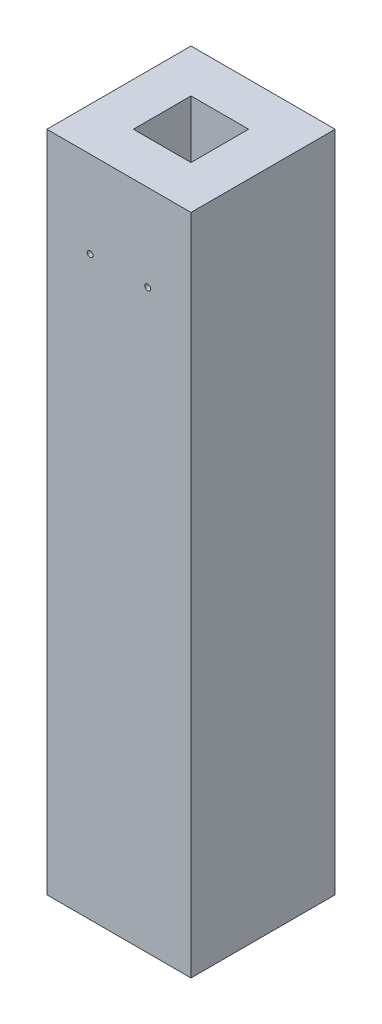
ISO-10303-21;
HEADER;
FILE_DESCRIPTION(('STEP AP214'),'2;1');
FILE_NAME('part.step','',(''),(''),'','','');
FILE_SCHEMA(('AUTOMOTIVE_DESIGN { 1 0 10303 214 1 1 1 1 }'));
ENDSEC;
DATA;
#1=APPLICATION_CONTEXT('core data for automotive mechanical design processes');
#2=APPLICATION_PROTOCOL_DEFINITION('international standard','automotive_design',2000,#1);
#3=PRODUCT_CONTEXT('',#1,'mechanical');
#4=PRODUCT('Part','Part','',(#3));
#5=PRODUCT_RELATED_PRODUCT_CATEGORY('part','',(#4));
#6=PRODUCT_DEFINITION_FORMATION('','',#4);
#7=PRODUCT_DEFINITION_CONTEXT('part definition',#1,'design');
#8=PRODUCT_DEFINITION('design','',#6,#7);
#9=PRODUCT_DEFINITION_SHAPE('','',#8);
#10=(LENGTH_UNIT() NAMED_UNIT(*) SI_UNIT(.MILLI.,.METRE.));
#11=(NAMED_UNIT(*) PLANE_ANGLE_UNIT() SI_UNIT($,.RADIAN.));
#12=(NAMED_UNIT(*) SI_UNIT($,.STERADIAN.) SOLID_ANGLE_UNIT());
#13=UNCERTAINTY_MEASURE_WITH_UNIT(LENGTH_MEASURE(1.E-05),#10,'distance_accuracy_value','');
#14=(GEOMETRIC_REPRESENTATION_CONTEXT(3) GLOBAL_UNCERTAINTY_ASSIGNED_CONTEXT((#13)) GLOBAL_UNIT_ASSIGNED_CONTEXT((#10,
#11,#12)) REPRESENTATION_CONTEXT('',''));
#15=CARTESIAN_POINT('',(0.,0.,0.));
#16=DIRECTION('',(0.,0.,1.));
#17=DIRECTION('',(1.,0.,0.));
#18=AXIS2_PLACEMENT_3D('',#15,#16,#17);
#19=CARTESIAN_POINT('',(-25.,230.,-25.));
#20=DIRECTION('',(1.,0.,0.));
#21=DIRECTION('',(0.,0.,-1.));
#22=AXIS2_PLACEMENT_3D('',#19,#20,#21);
#23=PLANE('',#22);
#24=DIRECTION('',(0.,0.,1.));
#25=VECTOR('',#24,1.);
#26=CARTESIAN_POINT('',(-25.,0.,-25.));
#27=LINE('',#26,#25);
#28=CARTESIAN_POINT('',(-25.,0.,-25.));
#29=VERTEX_POINT('',#28);
#30=CARTESIAN_POINT('',(-25.,0.,25.));
#31=VERTEX_POINT('',#30);
#32=EDGE_CURVE('E200',#29,#31,#27,.T.);
#33=ORIENTED_EDGE('',*,*,#32,.T.);
#34=DIRECTION('',(0.,-1.,0.));
#35=VECTOR('',#34,1.);
#36=CARTESIAN_POINT('',(-25.,230.,25.));
#37=LINE('',#36,#35);
#38=CARTESIAN_POINT('',(-25.,230.,25.));
#39=VERTEX_POINT('',#38);
#40=EDGE_CURVE('E11',#39,#31,#37,.T.);
#41=ORIENTED_EDGE('',*,*,#40,.F.);
#42=DIRECTION('',(0.,0.,1.));
#43=VECTOR('',#42,1.);
#44=CARTESIAN_POINT('',(-25.,230.,-25.));
#45=LINE('',#44,#43);
#46=CARTESIAN_POINT('',(-25.,230.,-25.));
#47=VERTEX_POINT('',#46);
#48=EDGE_CURVE('E201',#47,#39,#45,.T.);
#49=ORIENTED_EDGE('',*,*,#48,.F.);
#50=DIRECTION('',(0.,-1.,0.));
#51=VECTOR('',#50,1.);
#52=CARTESIAN_POINT('',(-25.,230.,-25.));
#53=LINE('',#52,#51);
#54=EDGE_CURVE('E211',#47,#29,#53,.T.);
#55=ORIENTED_EDGE('',*,*,#54,.T.);
#56=EDGE_LOOP('',(#33,#41,#49,#55));
#57=FACE_BOUND('',#56,.T.);
#58=ADVANCED_FACE('F34',(#57),#23,.F.);
#59=CARTESIAN_POINT('',(25.,230.,25.));
#60=DIRECTION('',(0.,0.,-1.));
#61=DIRECTION('',(-1.,0.,0.));
#62=AXIS2_PLACEMENT_3D('',#59,#60,#61);
#63=PLANE('',#62);
#64=CARTESIAN_POINT('',(10.,200.,25.));
#65=DIRECTION('',(0.,0.,1.));
#66=DIRECTION('',(1.,0.,0.));
#67=AXIS2_PLACEMENT_3D('',#64,#65,#66);
#68=CIRCLE('',#67,1.);
#69=CARTESIAN_POINT('',(11.,200.,25.));
#70=VERTEX_POINT('',#69);
#71=EDGE_CURVE('E325',#70,#70,#68,.T.);
#72=ORIENTED_EDGE('',*,*,#71,.F.);
#73=EDGE_LOOP('',(#72));
#74=FACE_BOUND('',#73,.T.);
#75=CARTESIAN_POINT('',(-10.,200.,25.));
#76=DIRECTION('',(0.,0.,1.));
#77=DIRECTION('',(1.,0.,0.));
#78=AXIS2_PLACEMENT_3D('',#75,#76,#77);
#79=CIRCLE('',#78,1.);
#80=CARTESIAN_POINT('',(-9.,200.,25.));
#81=VERTEX_POINT('',#80);
#82=EDGE_CURVE('E148',#81,#81,#79,.T.);
#83=ORIENTED_EDGE('',*,*,#82,.F.);
#84=EDGE_LOOP('',(#83));
#85=FACE_BOUND('',#84,.T.);
#86=DIRECTION('',(1.,0.,0.));
#87=VECTOR('',#86,1.);
#88=CARTESIAN_POINT('',(25.,0.,25.));
#89=LINE('',#88,#87);
#90=CARTESIAN_POINT('',(25.,0.,25.));
#91=VERTEX_POINT('',#90);
#92=EDGE_CURVE('E214',#31,#91,#89,.T.);
#93=ORIENTED_EDGE('',*,*,#92,.T.);
#94=DIRECTION('',(0.,-1.,0.));
#95=VECTOR('',#94,1.);
#96=CARTESIAN_POINT('',(25.,230.,25.));
#97=LINE('',#96,#95);
#98=CARTESIAN_POINT('',(25.,230.,25.));
#99=VERTEX_POINT('',#98);
#100=EDGE_CURVE('E41',#99,#91,#97,.T.);
#101=ORIENTED_EDGE('',*,*,#100,.F.);
#102=DIRECTION('',(1.,0.,0.));
#103=VECTOR('',#102,1.);
#104=CARTESIAN_POINT('',(25.,230.,25.));
#105=LINE('',#104,#103);
#106=EDGE_CURVE('E204',#39,#99,#105,.T.);
#107=ORIENTED_EDGE('',*,*,#106,.F.);
#108=ORIENTED_EDGE('',*,*,#40,.T.);
#109=EDGE_LOOP('',(#93,#101,#107,#108));
#110=FACE_BOUND('',#109,.T.);
#111=ADVANCED_FACE('F244',(#74,#85,#110),#63,.F.);
#112=CARTESIAN_POINT('',(25.,230.,-25.));
#113=DIRECTION('',(-1.,0.,0.));
#114=DIRECTION('',(0.,0.,1.));
#115=AXIS2_PLACEMENT_3D('',#112,#113,#114);
#116=PLANE('',#115);
#117=DIRECTION('',(0.,0.,-1.));
#118=VECTOR('',#117,1.);
#119=CARTESIAN_POINT('',(25.,0.,-25.));
#120=LINE('',#119,#118);
#121=CARTESIAN_POINT('',(25.,0.,-25.));
#122=VERTEX_POINT('',#121);
#123=EDGE_CURVE('E216',#91,#122,#120,.T.);
#124=ORIENTED_EDGE('',*,*,#123,.T.);
#125=DIRECTION('',(0.,-1.,0.));
#126=VECTOR('',#125,1.);
#127=CARTESIAN_POINT('',(25.,230.,-25.));
#128=LINE('',#127,#126);
#129=CARTESIAN_POINT('',(25.,230.,-25.));
#130=VERTEX_POINT('',#129);
#131=EDGE_CURVE('E221',#130,#122,#128,.T.);
#132=ORIENTED_EDGE('',*,*,#131,.F.);
#133=DIRECTION('',(0.,0.,-1.));
#134=VECTOR('',#133,1.);
#135=CARTESIAN_POINT('',(25.,230.,-25.));
#136=LINE('',#135,#134);
#137=EDGE_CURVE('E207',#99,#130,#136,.T.);
#138=ORIENTED_EDGE('',*,*,#137,.F.);
#139=ORIENTED_EDGE('',*,*,#100,.T.);
#140=EDGE_LOOP('',(#124,#132,#138,#139));
#141=FACE_BOUND('',#140,.T.);
#142=ADVANCED_FACE('F228',(#141),#116,.F.);
#143=CARTESIAN_POINT('',(25.,230.,-25.));
#144=DIRECTION('',(0.,0.,1.));
#145=DIRECTION('',(1.,0.,0.));
#146=AXIS2_PLACEMENT_3D('',#143,#144,#145);
#147=PLANE('',#146);
#148=DIRECTION('',(-1.,0.,0.));
#149=VECTOR('',#148,1.);
#150=CARTESIAN_POINT('',(25.,0.,-25.));
#151=LINE('',#150,#149);
#152=EDGE_CURVE('E205',#122,#29,#151,.T.);
#153=ORIENTED_EDGE('',*,*,#152,.T.);
#154=ORIENTED_EDGE('',*,*,#54,.F.);
#155=DIRECTION('',(-1.,0.,0.));
#156=VECTOR('',#155,1.);
#157=CARTESIAN_POINT('',(25.,230.,-25.));
#158=LINE('',#157,#156);
#159=EDGE_CURVE('E209',#130,#47,#158,.T.);
#160=ORIENTED_EDGE('',*,*,#159,.F.);
#161=ORIENTED_EDGE('',*,*,#131,.T.);
#162=EDGE_LOOP('',(#153,#154,#160,#161));
#163=FACE_BOUND('',#162,.T.);
#164=ADVANCED_FACE('F237',(#163),#147,.F.);
#165=CARTESIAN_POINT('',(0.,230.,0.));
#166=DIRECTION('',(0.,-1.,0.));
#167=DIRECTION('',(0.,0.,-1.));
#168=AXIS2_PLACEMENT_3D('',#165,#166,#167);
#169=PLANE('',#168);
#170=DIRECTION('',(1.,0.,0.));
#171=VECTOR('',#170,1.);
#172=CARTESIAN_POINT('',(10.,230.,10.));
#173=LINE('',#172,#171);
#174=CARTESIAN_POINT('',(-10.,230.,10.));
#175=VERTEX_POINT('',#174);
#176=CARTESIAN_POINT('',(10.,230.,10.));
#177=VERTEX_POINT('',#176);
#178=EDGE_CURVE('E154',#175,#177,#173,.T.);
#179=ORIENTED_EDGE('',*,*,#178,.F.);
#180=DIRECTION('',(0.,0.,1.));
#181=VECTOR('',#180,1.);
#182=CARTESIAN_POINT('',(-10.,230.,-10.));
#183=LINE('',#182,#181);
#184=CARTESIAN_POINT('',(-10.,230.,-10.));
#185=VERTEX_POINT('',#184);
#186=EDGE_CURVE('E48',#185,#175,#183,.T.);
#187=ORIENTED_EDGE('',*,*,#186,.F.);
#188=DIRECTION('',(-1.,0.,0.));
#189=VECTOR('',#188,1.);
#190=CARTESIAN_POINT('',(10.,230.,-10.));
#191=LINE('',#190,#189);
#192=CARTESIAN_POINT('',(10.,230.,-10.));
#193=VERTEX_POINT('',#192);
#194=EDGE_CURVE('E142',#193,#185,#191,.T.);
#195=ORIENTED_EDGE('',*,*,#194,.F.);
#196=DIRECTION('',(0.,0.,-1.));
#197=VECTOR('',#196,1.);
#198=CARTESIAN_POINT('',(10.,230.,-10.));
#199=LINE('',#198,#197);
#200=EDGE_CURVE('E145',#177,#193,#199,.T.);
#201=ORIENTED_EDGE('',*,*,#200,.F.);
#202=EDGE_LOOP('',(#179,#187,#195,#201));
#203=FACE_BOUND('',#202,.T.);
#204=ORIENTED_EDGE('',*,*,#48,.T.);
#205=ORIENTED_EDGE('',*,*,#106,.T.);
#206=ORIENTED_EDGE('',*,*,#137,.T.);
#207=ORIENTED_EDGE('',*,*,#159,.T.);
#208=EDGE_LOOP('',(#204,#205,#206,#207));
#209=FACE_BOUND('',#208,.T.);
#210=ADVANCED_FACE('F243',(#203,#209),#169,.F.);
#211=CARTESIAN_POINT('',(0.,0.,0.));
#212=DIRECTION('',(0.,-1.,0.));
#213=DIRECTION('',(0.,0.,-1.));
#214=AXIS2_PLACEMENT_3D('',#211,#212,#213);
#215=PLANE('',#214);
#216=DIRECTION('',(0.,0.,-1.));
#217=VECTOR('',#216,1.);
#218=CARTESIAN_POINT('',(-15.,0.,12.5));
#219=LINE('',#218,#217);
#220=CARTESIAN_POINT('',(-15.,0.,12.5));
#221=VERTEX_POINT('',#220);
#222=CARTESIAN_POINT('',(-15.,0.,-12.5));
#223=VERTEX_POINT('',#222);
#224=EDGE_CURVE('E56',#221,#223,#219,.T.);
#225=ORIENTED_EDGE('',*,*,#224,.F.);
#226=DIRECTION('',(-1.,0.,0.));
#227=VECTOR('',#226,1.);
#228=CARTESIAN_POINT('',(15.,0.,12.5));
#229=LINE('',#228,#227);
#230=CARTESIAN_POINT('',(15.,0.,12.5));
#231=VERTEX_POINT('',#230);
#232=EDGE_CURVE('E174',#231,#221,#229,.T.);
#233=ORIENTED_EDGE('',*,*,#232,.F.);
#234=DIRECTION('',(0.,0.,1.));
#235=VECTOR('',#234,1.);
#236=CARTESIAN_POINT('',(15.,0.,12.5));
#237=LINE('',#236,#235);
#238=CARTESIAN_POINT('',(15.,0.,-12.5));
#239=VERTEX_POINT('',#238);
#240=EDGE_CURVE('E185',#239,#231,#237,.T.);
#241=ORIENTED_EDGE('',*,*,#240,.F.);
#242=DIRECTION('',(1.,0.,0.));
#243=VECTOR('',#242,1.);
#244=CARTESIAN_POINT('',(15.,0.,-12.5));
#245=LINE('',#244,#243);
#246=EDGE_CURVE('E182',#223,#239,#245,.T.);
#247=ORIENTED_EDGE('',*,*,#246,.F.);
#248=EDGE_LOOP('',(#225,#233,#241,#247));
#249=FACE_BOUND('',#248,.T.);
#250=ORIENTED_EDGE('',*,*,#32,.F.);
#251=ORIENTED_EDGE('',*,*,#152,.F.);
#252=ORIENTED_EDGE('',*,*,#123,.F.);
#253=ORIENTED_EDGE('',*,*,#92,.F.);
#254=EDGE_LOOP('',(#250,#251,#252,#253));
#255=FACE_BOUND('',#254,.T.);
#256=ADVANCED_FACE('F234',(#249,#255),#215,.T.);
#257=CARTESIAN_POINT('',(-15.,-10.,12.5));
#258=DIRECTION('',(1.,0.,0.));
#259=DIRECTION('',(0.,0.,-1.));
#260=AXIS2_PLACEMENT_3D('',#257,#258,#259);
#261=PLANE('',#260);
#262=ORIENTED_EDGE('',*,*,#224,.T.);
#263=DIRECTION('',(0.,1.,0.));
#264=VECTOR('',#263,1.);
#265=CARTESIAN_POINT('',(-15.,-10.,-12.5));
#266=LINE('',#265,#264);
#267=CARTESIAN_POINT('',(-15.,-10.,-12.5));
#268=VERTEX_POINT('',#267);
#269=EDGE_CURVE('E197',#268,#223,#266,.T.);
#270=ORIENTED_EDGE('',*,*,#269,.F.);
#271=DIRECTION('',(0.,0.,-1.));
#272=VECTOR('',#271,1.);
#273=CARTESIAN_POINT('',(-15.,-10.,12.5));
#274=LINE('',#273,#272);
#275=CARTESIAN_POINT('',(-15.,-10.,12.5));
#276=VERTEX_POINT('',#275);
#277=EDGE_CURVE('E170',#276,#268,#274,.T.);
#278=ORIENTED_EDGE('',*,*,#277,.F.);
#279=DIRECTION('',(0.,1.,0.));
#280=VECTOR('',#279,1.);
#281=CARTESIAN_POINT('',(-15.,-10.,12.5));
#282=LINE('',#281,#280);
#283=EDGE_CURVE('E180',#276,#221,#282,.T.);
#284=ORIENTED_EDGE('',*,*,#283,.T.);
#285=EDGE_LOOP('',(#262,#270,#278,#284));
#286=FACE_BOUND('',#285,.T.);
#287=ADVANCED_FACE('F261',(#286),#261,.F.);
#288=CARTESIAN_POINT('',(15.,-10.,-12.5));
#289=DIRECTION('',(0.,0.,1.));
#290=DIRECTION('',(1.,0.,0.));
#291=AXIS2_PLACEMENT_3D('',#288,#289,#290);
#292=PLANE('',#291);
#293=ORIENTED_EDGE('',*,*,#246,.T.);
#294=DIRECTION('',(0.,1.,0.));
#295=VECTOR('',#294,1.);
#296=CARTESIAN_POINT('',(15.,-10.,-12.5));
#297=LINE('',#296,#295);
#298=CARTESIAN_POINT('',(15.,-10.,-12.5));
#299=VERTEX_POINT('',#298);
#300=EDGE_CURVE('E194',#299,#239,#297,.T.);
#301=ORIENTED_EDGE('',*,*,#300,.F.);
#302=DIRECTION('',(1.,0.,0.));
#303=VECTOR('',#302,1.);
#304=CARTESIAN_POINT('',(15.,-10.,-12.5));
#305=LINE('',#304,#303);
#306=EDGE_CURVE('E173',#268,#299,#305,.T.);
#307=ORIENTED_EDGE('',*,*,#306,.F.);
#308=ORIENTED_EDGE('',*,*,#269,.T.);
#309=EDGE_LOOP('',(#293,#301,#307,#308));
#310=FACE_BOUND('',#309,.T.);
#311=ADVANCED_FACE('F267',(#310),#292,.F.);
#312=CARTESIAN_POINT('',(15.,-10.,12.5));
#313=DIRECTION('',(-1.,0.,0.));
#314=DIRECTION('',(0.,0.,1.));
#315=AXIS2_PLACEMENT_3D('',#312,#313,#314);
#316=PLANE('',#315);
#317=ORIENTED_EDGE('',*,*,#240,.T.);
#318=DIRECTION('',(0.,1.,0.));
#319=VECTOR('',#318,1.);
#320=CARTESIAN_POINT('',(15.,-10.,12.5));
#321=LINE('',#320,#319);
#322=CARTESIAN_POINT('',(15.,-10.,12.5));
#323=VERTEX_POINT('',#322);
#324=EDGE_CURVE('E191',#323,#231,#321,.T.);
#325=ORIENTED_EDGE('',*,*,#324,.F.);
#326=DIRECTION('',(0.,0.,1.));
#327=VECTOR('',#326,1.);
#328=CARTESIAN_POINT('',(15.,-10.,12.5));
#329=LINE('',#328,#327);
#330=EDGE_CURVE('E176',#299,#323,#329,.T.);
#331=ORIENTED_EDGE('',*,*,#330,.F.);
#332=ORIENTED_EDGE('',*,*,#300,.T.);
#333=EDGE_LOOP('',(#317,#325,#331,#332));
#334=FACE_BOUND('',#333,.T.);
#335=ADVANCED_FACE('F271',(#334),#316,.F.);
#336=CARTESIAN_POINT('',(15.,-10.,12.5));
#337=DIRECTION('',(0.,0.,-1.));
#338=DIRECTION('',(-1.,0.,0.));
#339=AXIS2_PLACEMENT_3D('',#336,#337,#338);
#340=PLANE('',#339);
#341=ORIENTED_EDGE('',*,*,#232,.T.);
#342=ORIENTED_EDGE('',*,*,#283,.F.);
#343=DIRECTION('',(-1.,0.,0.));
#344=VECTOR('',#343,1.);
#345=CARTESIAN_POINT('',(15.,-10.,12.5));
#346=LINE('',#345,#344);
#347=EDGE_CURVE('E178',#323,#276,#346,.T.);
#348=ORIENTED_EDGE('',*,*,#347,.F.);
#349=ORIENTED_EDGE('',*,*,#324,.T.);
#350=EDGE_LOOP('',(#341,#342,#348,#349));
#351=FACE_BOUND('',#350,.T.);
#352=ADVANCED_FACE('F275',(#351),#340,.F.);
#353=CARTESIAN_POINT('',(0.,-10.,0.));
#354=DIRECTION('',(0.,1.,0.));
#355=DIRECTION('',(0.,0.,1.));
#356=AXIS2_PLACEMENT_3D('',#353,#354,#355);
#357=PLANE('',#356);
#358=CARTESIAN_POINT('',(0.,-10.,0.));
#359=DIRECTION('',(0.,-1.,0.));
#360=DIRECTION('',(0.,0.,-1.));
#361=AXIS2_PLACEMENT_3D('',#358,#359,#360);
#362=CIRCLE('',#361,5.);
#363=CARTESIAN_POINT('',(0.,-10.,-5.));
#364=VERTEX_POINT('',#363);
#365=EDGE_CURVE('E161',#364,#364,#362,.T.);
#366=ORIENTED_EDGE('',*,*,#365,.F.);
#367=EDGE_LOOP('',(#366));
#368=FACE_BOUND('',#367,.T.);
#369=ORIENTED_EDGE('',*,*,#277,.T.);
#370=ORIENTED_EDGE('',*,*,#306,.T.);
#371=ORIENTED_EDGE('',*,*,#330,.T.);
#372=ORIENTED_EDGE('',*,*,#347,.T.);
#373=EDGE_LOOP('',(#369,#370,#371,#372));
#374=FACE_BOUND('',#373,.T.);
#375=ADVANCED_FACE('F279',(#368,#374),#357,.F.);
#376=CARTESIAN_POINT('',(0.,90.,0.));
#377=DIRECTION('',(0.,-1.,0.));
#378=DIRECTION('',(0.,0.,-1.));
#379=AXIS2_PLACEMENT_3D('',#376,#377,#378);
#380=CYLINDRICAL_SURFACE('',#379,5.);
#381=CARTESIAN_POINT('',(0.,90.,0.));
#382=DIRECTION('',(0.,-1.,0.));
#383=DIRECTION('',(0.,0.,-1.));
#384=AXIS2_PLACEMENT_3D('',#381,#382,#383);
#385=CIRCLE('',#384,5.);
#386=CARTESIAN_POINT('',(0.,90.,-5.));
#387=VERTEX_POINT('',#386);
#388=EDGE_CURVE('E165',#387,#387,#385,.T.);
#389=ORIENTED_EDGE('',*,*,#388,.F.);
#390=EDGE_LOOP('',(#389));
#391=FACE_BOUND('',#390,.T.);
#392=ORIENTED_EDGE('',*,*,#365,.T.);
#393=EDGE_LOOP('',(#392));
#394=FACE_BOUND('',#393,.T.);
#395=ADVANCED_FACE('F283',(#391,#394),#380,.F.);
#396=CARTESIAN_POINT('',(0.,90.,0.));
#397=DIRECTION('',(0.,-1.,0.));
#398=DIRECTION('',(0.,0.,-1.));
#399=AXIS2_PLACEMENT_3D('',#396,#397,#398);
#400=PLANE('',#399);
#401=ORIENTED_EDGE('',*,*,#388,.T.);
#402=EDGE_LOOP('',(#401));
#403=FACE_BOUND('',#402,.T.);
#404=ADVANCED_FACE('F287',(#403),#400,.T.);
#405=CARTESIAN_POINT('',(-10.,209.,-10.));
#406=DIRECTION('',(-1.,0.,0.));
#407=DIRECTION('',(0.,0.,1.));
#408=AXIS2_PLACEMENT_3D('',#405,#406,#407);
#409=PLANE('',#408);
#410=ORIENTED_EDGE('',*,*,#186,.T.);
#411=DIRECTION('',(0.,1.,0.));
#412=VECTOR('',#411,1.);
#413=CARTESIAN_POINT('',(-10.,209.,10.));
#414=LINE('',#413,#412);
#415=CARTESIAN_POINT('',(-10.,209.,10.));
#416=VERTEX_POINT('',#415);
#417=EDGE_CURVE('E120',#416,#175,#414,.T.);
#418=ORIENTED_EDGE('',*,*,#417,.F.);
#419=DIRECTION('',(0.,0.,1.));
#420=VECTOR('',#419,1.);
#421=CARTESIAN_POINT('',(-10.,209.,-10.));
#422=LINE('',#421,#420);
#423=CARTESIAN_POINT('',(-10.,209.,-10.));
#424=VERTEX_POINT('',#423);
#425=EDGE_CURVE('E124',#424,#416,#422,.T.);
#426=ORIENTED_EDGE('',*,*,#425,.F.);
#427=DIRECTION('',(0.,1.,0.));
#428=VECTOR('',#427,1.);
#429=CARTESIAN_POINT('',(-10.,209.,-10.));
#430=LINE('',#429,#428);
#431=EDGE_CURVE('E159',#424,#185,#430,.T.);
#432=ORIENTED_EDGE('',*,*,#431,.T.);
#433=EDGE_LOOP('',(#410,#418,#426,#432));
#434=FACE_BOUND('',#433,.T.);
#435=ADVANCED_FACE('F122',(#434),#409,.F.);
#436=CARTESIAN_POINT('',(10.,209.,-10.));
#437=DIRECTION('',(0.,0.,-1.));
#438=DIRECTION('',(-1.,0.,0.));
#439=AXIS2_PLACEMENT_3D('',#436,#437,#438);
#440=PLANE('',#439);
#441=ORIENTED_EDGE('',*,*,#194,.T.);
#442=ORIENTED_EDGE('',*,*,#431,.F.);
#443=DIRECTION('',(-1.,0.,0.));
#444=VECTOR('',#443,1.);
#445=CARTESIAN_POINT('',(10.,209.,-10.));
#446=LINE('',#445,#444);
#447=CARTESIAN_POINT('',(10.,209.,-10.));
#448=VERTEX_POINT('',#447);
#449=EDGE_CURVE('E130',#448,#424,#446,.T.);
#450=ORIENTED_EDGE('',*,*,#449,.F.);
#451=DIRECTION('',(0.,1.,0.));
#452=VECTOR('',#451,1.);
#453=CARTESIAN_POINT('',(10.,209.,-10.));
#454=LINE('',#453,#452);
#455=EDGE_CURVE('E162',#448,#193,#454,.T.);
#456=ORIENTED_EDGE('',*,*,#455,.T.);
#457=EDGE_LOOP('',(#441,#442,#450,#456));
#458=FACE_BOUND('',#457,.T.);
#459=ADVANCED_FACE('F294',(#458),#440,.F.);
#460=CARTESIAN_POINT('',(10.,209.,-10.));
#461=DIRECTION('',(1.,0.,0.));
#462=DIRECTION('',(0.,0.,-1.));
#463=AXIS2_PLACEMENT_3D('',#460,#461,#462);
#464=PLANE('',#463);
#465=ORIENTED_EDGE('',*,*,#200,.T.);
#466=ORIENTED_EDGE('',*,*,#455,.F.);
#467=DIRECTION('',(0.,0.,-1.));
#468=VECTOR('',#467,1.);
#469=CARTESIAN_POINT('',(10.,209.,-10.));
#470=LINE('',#469,#468);
#471=CARTESIAN_POINT('',(10.,209.,10.));
#472=VERTEX_POINT('',#471);
#473=EDGE_CURVE('E138',#472,#448,#470,.T.);
#474=ORIENTED_EDGE('',*,*,#473,.F.);
#475=DIRECTION('',(0.,1.,0.));
#476=VECTOR('',#475,1.);
#477=CARTESIAN_POINT('',(10.,209.,10.));
#478=LINE('',#477,#476);
#479=EDGE_CURVE('E129',#472,#177,#478,.T.);
#480=ORIENTED_EDGE('',*,*,#479,.T.);
#481=EDGE_LOOP('',(#465,#466,#474,#480));
#482=FACE_BOUND('',#481,.T.);
#483=ADVANCED_FACE('F297',(#482),#464,.F.);
#484=CARTESIAN_POINT('',(10.,209.,10.));
#485=DIRECTION('',(0.,0.,1.));
#486=DIRECTION('',(1.,0.,0.));
#487=AXIS2_PLACEMENT_3D('',#484,#485,#486);
#488=PLANE('',#487);
#489=ORIENTED_EDGE('',*,*,#178,.T.);
#490=ORIENTED_EDGE('',*,*,#479,.F.);
#491=DIRECTION('',(1.,0.,0.));
#492=VECTOR('',#491,1.);
#493=CARTESIAN_POINT('',(10.,209.,10.));
#494=LINE('',#493,#492);
#495=EDGE_CURVE('E133',#416,#472,#494,.T.);
#496=ORIENTED_EDGE('',*,*,#495,.F.);
#497=ORIENTED_EDGE('',*,*,#417,.T.);
#498=EDGE_LOOP('',(#489,#490,#496,#497));
#499=FACE_BOUND('',#498,.T.);
#500=ADVANCED_FACE('F134',(#499),#488,.F.);
#501=CARTESIAN_POINT('',(0.,209.,0.));
#502=DIRECTION('',(0.,-1.,0.));
#503=DIRECTION('',(0.,0.,-1.));
#504=AXIS2_PLACEMENT_3D('',#501,#502,#503);
#505=PLANE('',#504);
#506=ORIENTED_EDGE('',*,*,#425,.T.);
#507=ORIENTED_EDGE('',*,*,#495,.T.);
#508=ORIENTED_EDGE('',*,*,#473,.T.);
#509=ORIENTED_EDGE('',*,*,#449,.T.);
#510=EDGE_LOOP('',(#506,#507,#508,#509));
#511=FACE_BOUND('',#510,.T.);
#512=ADVANCED_FACE('F140',(#511),#505,.F.);
#513=CARTESIAN_POINT('',(-10.,200.,10.));
#514=DIRECTION('',(0.,0.,1.));
#515=DIRECTION('',(1.,0.,0.));
#516=AXIS2_PLACEMENT_3D('',#513,#514,#515);
#517=CYLINDRICAL_SURFACE('',#516,1.);
#518=CARTESIAN_POINT('',(-10.,200.,10.));
#519=DIRECTION('',(0.,0.,1.));
#520=DIRECTION('',(1.,0.,0.));
#521=AXIS2_PLACEMENT_3D('',#518,#519,#520);
#522=CIRCLE('',#521,1.);
#523=CARTESIAN_POINT('',(-9.,200.,10.));
#524=VERTEX_POINT('',#523);
#525=EDGE_CURVE('E328',#524,#524,#522,.T.);
#526=ORIENTED_EDGE('',*,*,#525,.F.);
#527=EDGE_LOOP('',(#526));
#528=FACE_BOUND('',#527,.T.);
#529=ORIENTED_EDGE('',*,*,#82,.T.);
#530=EDGE_LOOP('',(#529));
#531=FACE_BOUND('',#530,.T.);
#532=ADVANCED_FACE('F306',(#528,#531),#517,.F.);
#533=CARTESIAN_POINT('',(-10.,200.,10.));
#534=DIRECTION('',(0.,0.,1.));
#535=DIRECTION('',(1.,0.,0.));
#536=AXIS2_PLACEMENT_3D('',#533,#534,#535);
#537=PLANE('',#536);
#538=ORIENTED_EDGE('',*,*,#525,.T.);
#539=EDGE_LOOP('',(#538));
#540=FACE_BOUND('',#539,.T.);
#541=ADVANCED_FACE('F309',(#540),#537,.T.);
#542=CARTESIAN_POINT('',(10.,200.,10.));
#543=DIRECTION('',(0.,0.,1.));
#544=DIRECTION('',(1.,0.,0.));
#545=AXIS2_PLACEMENT_3D('',#542,#543,#544);
#546=CYLINDRICAL_SURFACE('',#545,1.);
#547=CARTESIAN_POINT('',(10.,200.,10.));
#548=DIRECTION('',(0.,0.,1.));
#549=DIRECTION('',(1.,0.,0.));
#550=AXIS2_PLACEMENT_3D('',#547,#548,#549);
#551=CIRCLE('',#550,1.);
#552=CARTESIAN_POINT('',(11.,200.,10.));
#553=VERTEX_POINT('',#552);
#554=EDGE_CURVE('E155',#553,#553,#551,.T.);
#555=ORIENTED_EDGE('',*,*,#554,.F.);
#556=EDGE_LOOP('',(#555));
#557=FACE_BOUND('',#556,.T.);
#558=ORIENTED_EDGE('',*,*,#71,.T.);
#559=EDGE_LOOP('',(#558));
#560=FACE_BOUND('',#559,.T.);
#561=ADVANCED_FACE('F313',(#557,#560),#546,.F.);
#562=CARTESIAN_POINT('',(10.,200.,10.));
#563=DIRECTION('',(0.,0.,1.));
#564=DIRECTION('',(1.,0.,0.));
#565=AXIS2_PLACEMENT_3D('',#562,#563,#564);
#566=PLANE('',#565);
#567=ORIENTED_EDGE('',*,*,#554,.T.);
#568=EDGE_LOOP('',(#567));
#569=FACE_BOUND('',#568,.T.);
#570=ADVANCED_FACE('F317',(#569),#566,.T.);
#571=CLOSED_SHELL('',(#58,#111,#142,#164,#210,#256,#287,#311,#335,#352,#375,#395,#404,#435,#459,
#483,#500,#512,#532,#541,#561,#570));
#572=MANIFOLD_SOLID_BREP('B2',#571);
#573=ADVANCED_BREP_SHAPE_REPRESENTATION('',(#18,#572),#14);
#574=SHAPE_DEFINITION_REPRESENTATION(#9,#573);
ENDSEC;
END-ISO-10303-21;
